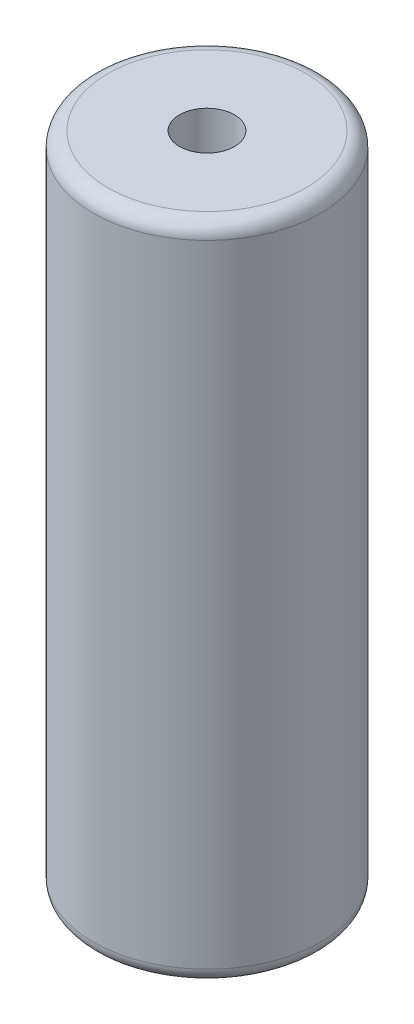
ISO-10303-21;
HEADER;
FILE_DESCRIPTION(('STEP AP214'),'2;1');
FILE_NAME('part.step','',(''),(''),'','','');
FILE_SCHEMA(('AUTOMOTIVE_DESIGN { 1 0 10303 214 1 1 1 1 }'));
ENDSEC;
DATA;
#1=APPLICATION_CONTEXT('core data for automotive mechanical design processes');
#2=APPLICATION_PROTOCOL_DEFINITION('international standard','automotive_design',2000,#1);
#3=PRODUCT_CONTEXT('',#1,'mechanical');
#4=PRODUCT('Part','Part','',(#3));
#5=PRODUCT_RELATED_PRODUCT_CATEGORY('part','',(#4));
#6=PRODUCT_DEFINITION_FORMATION('','',#4);
#7=PRODUCT_DEFINITION_CONTEXT('part definition',#1,'design');
#8=PRODUCT_DEFINITION('design','',#6,#7);
#9=PRODUCT_DEFINITION_SHAPE('','',#8);
#10=(LENGTH_UNIT() NAMED_UNIT(*) SI_UNIT(.MILLI.,.METRE.));
#11=(NAMED_UNIT(*) PLANE_ANGLE_UNIT() SI_UNIT($,.RADIAN.));
#12=(NAMED_UNIT(*) SI_UNIT($,.STERADIAN.) SOLID_ANGLE_UNIT());
#13=UNCERTAINTY_MEASURE_WITH_UNIT(LENGTH_MEASURE(1.E-05),#10,'distance_accuracy_value','');
#14=(GEOMETRIC_REPRESENTATION_CONTEXT(3) GLOBAL_UNCERTAINTY_ASSIGNED_CONTEXT((#13)) GLOBAL_UNIT_ASSIGNED_CONTEXT((#10,
#11,#12)) REPRESENTATION_CONTEXT('',''));
#15=CARTESIAN_POINT('',(0.,0.,0.));
#16=DIRECTION('',(0.,0.,1.));
#17=DIRECTION('',(1.,0.,0.));
#18=AXIS2_PLACEMENT_3D('',#15,#16,#17);
#19=CARTESIAN_POINT('',(0.,18.,0.));
#20=DIRECTION('',(0.,1.,0.));
#21=DIRECTION('',(0.,0.,1.));
#22=AXIS2_PLACEMENT_3D('',#19,#20,#21);
#23=PLANE('',#22);
#24=CARTESIAN_POINT('',(0.,18.,0.));
#25=DIRECTION('',(0.,1.,0.));
#26=DIRECTION('',(0.,0.,1.));
#27=AXIS2_PLACEMENT_3D('',#24,#25,#26);
#28=CIRCLE('',#27,2.7);
#29=CARTESIAN_POINT('',(0.,18.,2.7));
#30=VERTEX_POINT('',#29);
#31=EDGE_CURVE('E10',#30,#30,#28,.T.);
#32=ORIENTED_EDGE('',*,*,#31,.T.);
#33=EDGE_LOOP('',(#32));
#34=FACE_BOUND('',#33,.T.);
#35=CARTESIAN_POINT('',(0.,18.,0.));
#36=DIRECTION('',(0.,1.,0.));
#37=DIRECTION('',(0.,0.,1.));
#38=AXIS2_PLACEMENT_3D('',#35,#36,#37);
#39=CIRCLE('',#38,0.750000000000001);
#40=CARTESIAN_POINT('',(0.,18.,0.750000000000001));
#41=VERTEX_POINT('',#40);
#42=EDGE_CURVE('E52',#41,#41,#39,.T.);
#43=ORIENTED_EDGE('',*,*,#42,.F.);
#44=EDGE_LOOP('',(#43));
#45=FACE_BOUND('',#44,.T.);
#46=ADVANCED_FACE('F32',(#34,#45),#23,.T.);
#47=CARTESIAN_POINT('',(0.,0.,0.));
#48=DIRECTION('',(0.,1.,0.));
#49=DIRECTION('',(0.,0.,1.));
#50=AXIS2_PLACEMENT_3D('',#47,#48,#49);
#51=PLANE('',#50);
#52=CARTESIAN_POINT('',(0.,0.,0.));
#53=DIRECTION('',(0.,1.,0.));
#54=DIRECTION('',(0.,0.,1.));
#55=AXIS2_PLACEMENT_3D('',#52,#53,#54);
#56=CIRCLE('',#55,2.7);
#57=CARTESIAN_POINT('',(0.,0.,2.7));
#58=VERTEX_POINT('',#57);
#59=EDGE_CURVE('E39',#58,#58,#56,.F.);
#60=ORIENTED_EDGE('',*,*,#59,.T.);
#61=EDGE_LOOP('',(#60));
#62=FACE_BOUND('',#61,.T.);
#63=CARTESIAN_POINT('',(0.,0.,0.));
#64=DIRECTION('',(0.,1.,0.));
#65=DIRECTION('',(0.,0.,1.));
#66=AXIS2_PLACEMENT_3D('',#63,#64,#65);
#67=CIRCLE('',#66,0.750000000000001);
#68=CARTESIAN_POINT('',(0.,0.,0.750000000000001));
#69=VERTEX_POINT('',#68);
#70=EDGE_CURVE('E53',#69,#69,#67,.T.);
#71=ORIENTED_EDGE('',*,*,#70,.T.);
#72=EDGE_LOOP('',(#71));
#73=FACE_BOUND('',#72,.T.);
#74=ADVANCED_FACE('F63',(#62,#73),#51,.F.);
#75=CARTESIAN_POINT('',(0.,18.,0.));
#76=DIRECTION('',(0.,-1.,0.));
#77=DIRECTION('',(0.,0.,-1.));
#78=AXIS2_PLACEMENT_3D('',#75,#76,#77);
#79=CYLINDRICAL_SURFACE('',#78,3.1);
#80=CARTESIAN_POINT('',(0.,0.400000000000001,0.));
#81=DIRECTION('',(0.,1.,0.));
#82=DIRECTION('',(0.,0.,1.));
#83=AXIS2_PLACEMENT_3D('',#80,#81,#82);
#84=CIRCLE('',#83,3.1);
#85=CARTESIAN_POINT('',(0.,0.400000000000001,3.1));
#86=VERTEX_POINT('',#85);
#87=EDGE_CURVE('E43',#86,#86,#84,.T.);
#88=ORIENTED_EDGE('',*,*,#87,.T.);
#89=EDGE_LOOP('',(#88));
#90=FACE_BOUND('',#89,.T.);
#91=CARTESIAN_POINT('',(0.,17.6,0.));
#92=DIRECTION('',(0.,1.,0.));
#93=DIRECTION('',(0.,0.,1.));
#94=AXIS2_PLACEMENT_3D('',#91,#92,#93);
#95=CIRCLE('',#94,3.1);
#96=CARTESIAN_POINT('',(0.,17.6,3.1));
#97=VERTEX_POINT('',#96);
#98=EDGE_CURVE('E47',#97,#97,#95,.F.);
#99=ORIENTED_EDGE('',*,*,#98,.T.);
#100=EDGE_LOOP('',(#99));
#101=FACE_BOUND('',#100,.T.);
#102=ADVANCED_FACE('F68',(#90,#101),#79,.T.);
#103=CARTESIAN_POINT('',(0.,18.,0.));
#104=DIRECTION('',(0.,-1.,0.));
#105=DIRECTION('',(0.,0.,-1.));
#106=AXIS2_PLACEMENT_3D('',#103,#104,#105);
#107=CYLINDRICAL_SURFACE('',#106,0.750000000000001);
#108=ORIENTED_EDGE('',*,*,#42,.T.);
#109=EDGE_LOOP('',(#108));
#110=FACE_BOUND('',#109,.T.);
#111=ORIENTED_EDGE('',*,*,#70,.F.);
#112=EDGE_LOOP('',(#111));
#113=FACE_BOUND('',#112,.T.);
#114=ADVANCED_FACE('F59',(#110,#113),#107,.F.);
#115=CARTESIAN_POINT('',(0.,0.400000000000001,0.));
#116=DIRECTION('',(0.,1.,0.));
#117=DIRECTION('',(0.,0.,1.));
#118=AXIS2_PLACEMENT_3D('',#115,#116,#117);
#119=TOROIDAL_SURFACE('',#118,2.7,0.4);
#120=ORIENTED_EDGE('',*,*,#59,.F.);
#121=EDGE_LOOP('',(#120));
#122=FACE_BOUND('',#121,.T.);
#123=ORIENTED_EDGE('',*,*,#87,.F.);
#124=EDGE_LOOP('',(#123));
#125=FACE_BOUND('',#124,.T.);
#126=ADVANCED_FACE('F74',(#122,#125),#119,.T.);
#127=CARTESIAN_POINT('',(0.,17.6,0.));
#128=DIRECTION('',(0.,1.,0.));
#129=DIRECTION('',(0.,0.,1.));
#130=AXIS2_PLACEMENT_3D('',#127,#128,#129);
#131=TOROIDAL_SURFACE('',#130,2.7,0.4);
#132=ORIENTED_EDGE('',*,*,#98,.F.);
#133=EDGE_LOOP('',(#132));
#134=FACE_BOUND('',#133,.T.);
#135=ORIENTED_EDGE('',*,*,#31,.F.);
#136=EDGE_LOOP('',(#135));
#137=FACE_BOUND('',#136,.T.);
#138=ADVANCED_FACE('F34',(#134,#137),#131,.T.);
#139=CLOSED_SHELL('',(#46,#74,#102,#114,#126,#138));
#140=MANIFOLD_SOLID_BREP('B2',#139);
#141=ADVANCED_BREP_SHAPE_REPRESENTATION('',(#18,#140),#14);
#142=SHAPE_DEFINITION_REPRESENTATION(#9,#141);
ENDSEC;
END-ISO-10303-21;
